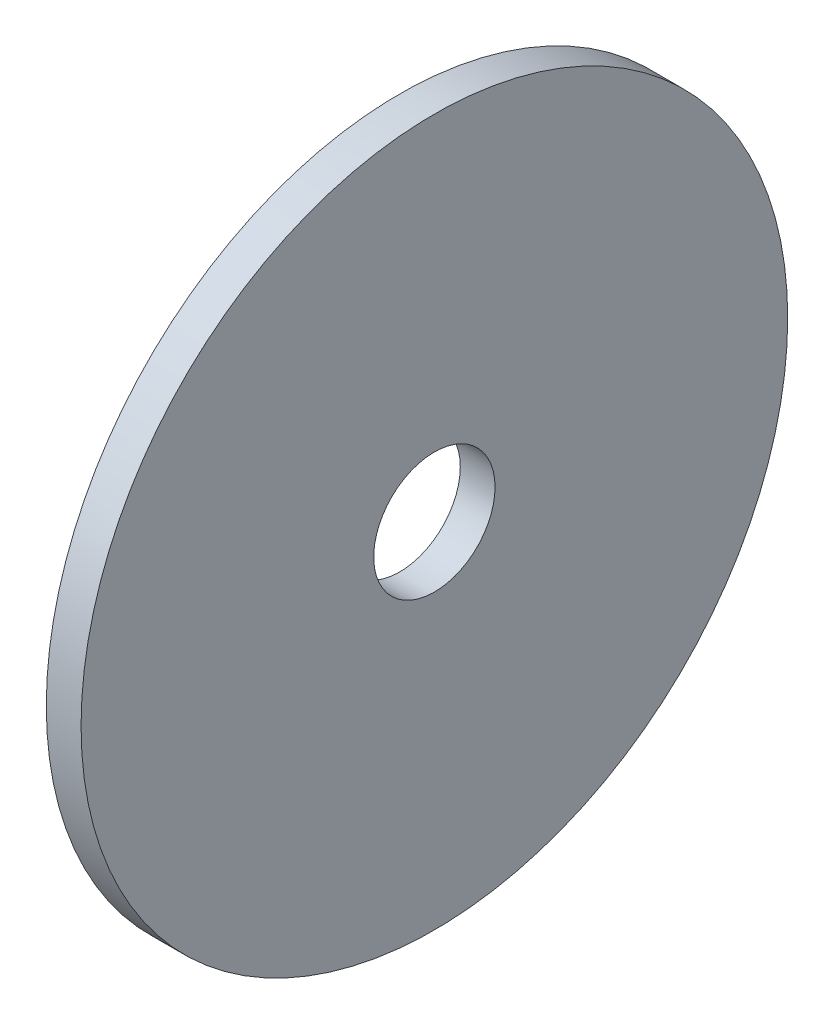
ISO-10303-21;
HEADER;
FILE_DESCRIPTION(('STEP AP214'),'2;1');
FILE_NAME('part.step','',(''),(''),'','','');
FILE_SCHEMA(('AUTOMOTIVE_DESIGN { 1 0 10303 214 1 1 1 1 }'));
ENDSEC;
DATA;
#1=APPLICATION_CONTEXT('core data for automotive mechanical design processes');
#2=APPLICATION_PROTOCOL_DEFINITION('international standard','automotive_design',2000,#1);
#3=PRODUCT_CONTEXT('',#1,'mechanical');
#4=PRODUCT('Part','Part','',(#3));
#5=PRODUCT_RELATED_PRODUCT_CATEGORY('part','',(#4));
#6=PRODUCT_DEFINITION_FORMATION('','',#4);
#7=PRODUCT_DEFINITION_CONTEXT('part definition',#1,'design');
#8=PRODUCT_DEFINITION('design','',#6,#7);
#9=PRODUCT_DEFINITION_SHAPE('','',#8);
#10=(LENGTH_UNIT() NAMED_UNIT(*) SI_UNIT(.MILLI.,.METRE.));
#11=(NAMED_UNIT(*) PLANE_ANGLE_UNIT() SI_UNIT($,.RADIAN.));
#12=(NAMED_UNIT(*) SI_UNIT($,.STERADIAN.) SOLID_ANGLE_UNIT());
#13=UNCERTAINTY_MEASURE_WITH_UNIT(LENGTH_MEASURE(1.E-05),#10,'distance_accuracy_value','');
#14=(GEOMETRIC_REPRESENTATION_CONTEXT(3) GLOBAL_UNCERTAINTY_ASSIGNED_CONTEXT((#13)) GLOBAL_UNIT_ASSIGNED_CONTEXT((#10,
#11,#12)) REPRESENTATION_CONTEXT('',''));
#15=CARTESIAN_POINT('',(0.,0.,0.));
#16=DIRECTION('',(0.,0.,1.));
#17=DIRECTION('',(1.,0.,0.));
#18=AXIS2_PLACEMENT_3D('',#15,#16,#17);
#19=CARTESIAN_POINT('',(531.495,0.,0.));
#20=DIRECTION('',(1.,0.,0.));
#21=DIRECTION('',(0.,0.,-1.));
#22=AXIS2_PLACEMENT_3D('',#19,#20,#21);
#23=PLANE('',#22);
#24=CARTESIAN_POINT('',(531.495,0.,0.));
#25=DIRECTION('',(1.,0.,0.));
#26=DIRECTION('',(0.,0.,-1.));
#27=AXIS2_PLACEMENT_3D('',#24,#25,#26);
#28=CIRCLE('',#27,9.525);
#29=CARTESIAN_POINT('',(531.495,0.,-9.525));
#30=VERTEX_POINT('',#29);
#31=EDGE_CURVE('E58',#30,#30,#28,.T.);
#32=ORIENTED_EDGE('',*,*,#31,.T.);
#33=EDGE_LOOP('',(#32));
#34=FACE_BOUND('',#33,.T.);
#35=CARTESIAN_POINT('',(531.495,0.,0.));
#36=DIRECTION('',(1.,0.,0.));
#37=DIRECTION('',(0.,0.,-1.));
#38=AXIS2_PLACEMENT_3D('',#35,#36,#37);
#39=CIRCLE('',#38,55.4801039444911);
#40=CARTESIAN_POINT('',(531.495,0.,-55.4801039444911));
#41=VERTEX_POINT('',#40);
#42=EDGE_CURVE('E11',#41,#41,#39,.T.);
#43=ORIENTED_EDGE('',*,*,#42,.F.);
#44=EDGE_LOOP('',(#43));
#45=FACE_BOUND('',#44,.T.);
#46=ADVANCED_FACE('F46',(#34,#45),#23,.F.);
#47=CARTESIAN_POINT('',(531.495,0.,0.));
#48=DIRECTION('',(1.,0.,0.));
#49=DIRECTION('',(0.,0.,-1.));
#50=AXIS2_PLACEMENT_3D('',#47,#48,#49);
#51=CYLINDRICAL_SURFACE('',#50,55.4801039444911);
#52=ORIENTED_EDGE('',*,*,#42,.T.);
#53=EDGE_LOOP('',(#52));
#54=FACE_BOUND('',#53,.T.);
#55=CARTESIAN_POINT('',(536.956,0.,0.));
#56=DIRECTION('',(1.,0.,0.));
#57=DIRECTION('',(0.,0.,-1.));
#58=AXIS2_PLACEMENT_3D('',#55,#56,#57);
#59=CIRCLE('',#58,55.4801039444911);
#60=CARTESIAN_POINT('',(536.956,0.,-55.4801039444911));
#61=VERTEX_POINT('',#60);
#62=EDGE_CURVE('E49',#61,#61,#59,.T.);
#63=ORIENTED_EDGE('',*,*,#62,.F.);
#64=EDGE_LOOP('',(#63));
#65=FACE_BOUND('',#64,.T.);
#66=ADVANCED_FACE('F79',(#54,#65),#51,.T.);
#67=CARTESIAN_POINT('',(536.956,0.,0.));
#68=DIRECTION('',(1.,0.,0.));
#69=DIRECTION('',(0.,0.,-1.));
#70=AXIS2_PLACEMENT_3D('',#67,#68,#69);
#71=PLANE('',#70);
#72=CARTESIAN_POINT('',(536.956,0.,0.));
#73=DIRECTION('',(1.,0.,0.));
#74=DIRECTION('',(0.,0.,-1.));
#75=AXIS2_PLACEMENT_3D('',#72,#73,#74);
#76=CIRCLE('',#75,9.525);
#77=CARTESIAN_POINT('',(536.956,0.,-9.525));
#78=VERTEX_POINT('',#77);
#79=EDGE_CURVE('E60',#78,#78,#76,.T.);
#80=ORIENTED_EDGE('',*,*,#79,.F.);
#81=EDGE_LOOP('',(#80));
#82=FACE_BOUND('',#81,.T.);
#83=ORIENTED_EDGE('',*,*,#62,.T.);
#84=EDGE_LOOP('',(#83));
#85=FACE_BOUND('',#84,.T.);
#86=ADVANCED_FACE('F73',(#82,#85),#71,.T.);
#87=CARTESIAN_POINT('',(531.495,0.,0.));
#88=DIRECTION('',(1.,0.,0.));
#89=DIRECTION('',(0.,0.,-1.));
#90=AXIS2_PLACEMENT_3D('',#87,#88,#89);
#91=CYLINDRICAL_SURFACE('',#90,9.525);
#92=ORIENTED_EDGE('',*,*,#31,.F.);
#93=EDGE_LOOP('',(#92));
#94=FACE_BOUND('',#93,.T.);
#95=ORIENTED_EDGE('',*,*,#79,.T.);
#96=EDGE_LOOP('',(#95));
#97=FACE_BOUND('',#96,.T.);
#98=ADVANCED_FACE('F70',(#94,#97),#91,.F.);
#99=CLOSED_SHELL('',(#46,#66,#86,#98));
#100=MANIFOLD_SOLID_BREP('B2',#99);
#101=ADVANCED_BREP_SHAPE_REPRESENTATION('',(#18,#100),#14);
#102=SHAPE_DEFINITION_REPRESENTATION(#9,#101);
ENDSEC;
END-ISO-10303-21;
